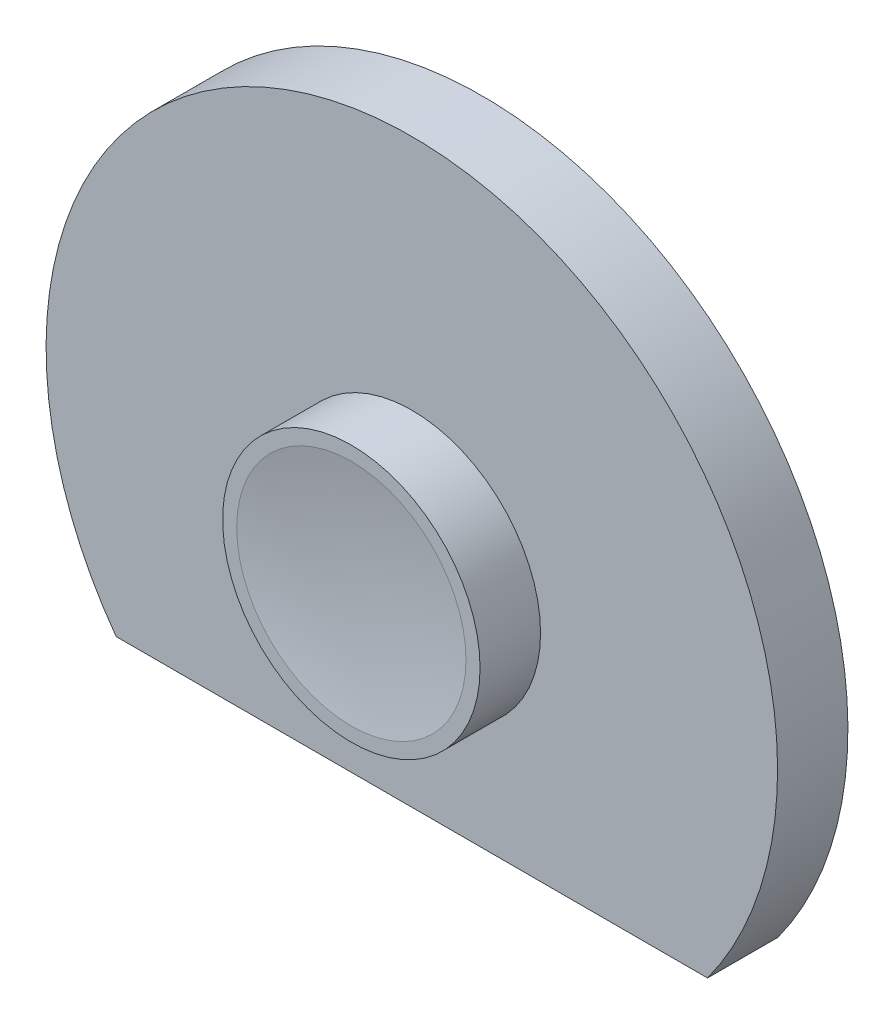
ISO-10303-21;
HEADER;
FILE_DESCRIPTION(('STEP AP214'),'2;1');
FILE_NAME('part.step','',(''),(''),'','','');
FILE_SCHEMA(('AUTOMOTIVE_DESIGN { 1 0 10303 214 1 1 1 1 }'));
ENDSEC;
DATA;
#1=APPLICATION_CONTEXT('core data for automotive mechanical design processes');
#2=APPLICATION_PROTOCOL_DEFINITION('international standard','automotive_design',2000,#1);
#3=PRODUCT_CONTEXT('',#1,'mechanical');
#4=PRODUCT('Part','Part','',(#3));
#5=PRODUCT_RELATED_PRODUCT_CATEGORY('part','',(#4));
#6=PRODUCT_DEFINITION_FORMATION('','',#4);
#7=PRODUCT_DEFINITION_CONTEXT('part definition',#1,'design');
#8=PRODUCT_DEFINITION('design','',#6,#7);
#9=PRODUCT_DEFINITION_SHAPE('','',#8);
#10=(LENGTH_UNIT() NAMED_UNIT(*) SI_UNIT(.MILLI.,.METRE.));
#11=(NAMED_UNIT(*) PLANE_ANGLE_UNIT() SI_UNIT($,.RADIAN.));
#12=(NAMED_UNIT(*) SI_UNIT($,.STERADIAN.) SOLID_ANGLE_UNIT());
#13=UNCERTAINTY_MEASURE_WITH_UNIT(LENGTH_MEASURE(1.E-05),#10,'distance_accuracy_value','');
#14=(GEOMETRIC_REPRESENTATION_CONTEXT(3) GLOBAL_UNCERTAINTY_ASSIGNED_CONTEXT((#13)) GLOBAL_UNIT_ASSIGNED_CONTEXT((#10,
#11,#12)) REPRESENTATION_CONTEXT('',''));
#15=CARTESIAN_POINT('',(0.,0.,0.));
#16=DIRECTION('',(0.,0.,1.));
#17=DIRECTION('',(1.,0.,0.));
#18=AXIS2_PLACEMENT_3D('',#15,#16,#17);
#19=CARTESIAN_POINT('',(0.,0.,5.));
#20=DIRECTION('',(0.,0.,-1.));
#21=DIRECTION('',(-1.,0.,0.));
#22=AXIS2_PLACEMENT_3D('',#19,#20,#21);
#23=CYLINDRICAL_SURFACE('',#22,26.);
#24=CARTESIAN_POINT('',(0.,0.,0.));
#25=DIRECTION('',(0.,0.,1.));
#26=DIRECTION('',(1.,0.,0.));
#27=AXIS2_PLACEMENT_3D('',#24,#25,#26);
#28=CIRCLE('',#27,26.);
#29=CARTESIAN_POINT('',(21.0216555009352,-15.3,0.));
#30=VERTEX_POINT('',#29);
#31=CARTESIAN_POINT('',(-21.0216555009352,-15.3,0.));
#32=VERTEX_POINT('',#31);
#33=EDGE_CURVE('E75',#30,#32,#28,.T.);
#34=ORIENTED_EDGE('',*,*,#33,.T.);
#35=DIRECTION('',(0.,0.,-1.));
#36=VECTOR('',#35,1.);
#37=CARTESIAN_POINT('',(-21.0216555009352,-15.3,5.));
#38=LINE('',#37,#36);
#39=CARTESIAN_POINT('',(-21.0216555009352,-15.3,5.));
#40=VERTEX_POINT('',#39);
#41=EDGE_CURVE('E42',#40,#32,#38,.T.);
#42=ORIENTED_EDGE('',*,*,#41,.F.);
#43=CARTESIAN_POINT('',(0.,0.,5.));
#44=DIRECTION('',(0.,0.,1.));
#45=DIRECTION('',(1.,0.,0.));
#46=AXIS2_PLACEMENT_3D('',#43,#44,#45);
#47=CIRCLE('',#46,26.);
#48=CARTESIAN_POINT('',(21.0216555009352,-15.3,5.));
#49=VERTEX_POINT('',#48);
#50=EDGE_CURVE('E74',#49,#40,#47,.T.);
#51=ORIENTED_EDGE('',*,*,#50,.F.);
#52=DIRECTION('',(0.,0.,-1.));
#53=VECTOR('',#52,1.);
#54=CARTESIAN_POINT('',(21.0216555009352,-15.3,5.));
#55=LINE('',#54,#53);
#56=EDGE_CURVE('E69',#49,#30,#55,.T.);
#57=ORIENTED_EDGE('',*,*,#56,.T.);
#58=EDGE_LOOP('',(#34,#42,#51,#57));
#59=FACE_BOUND('',#58,.T.);
#60=ADVANCED_FACE('F39',(#59),#23,.T.);
#61=CARTESIAN_POINT('',(-21.0216555009352,-15.3,5.));
#62=DIRECTION('',(0.,1.,0.));
#63=DIRECTION('',(0.,0.,1.));
#64=AXIS2_PLACEMENT_3D('',#61,#62,#63);
#65=PLANE('',#64);
#66=DIRECTION('',(1.,0.,0.));
#67=VECTOR('',#66,1.);
#68=CARTESIAN_POINT('',(-21.0216555009352,-15.3,0.));
#69=LINE('',#68,#67);
#70=EDGE_CURVE('E64',#32,#30,#69,.T.);
#71=ORIENTED_EDGE('',*,*,#70,.T.);
#72=ORIENTED_EDGE('',*,*,#56,.F.);
#73=DIRECTION('',(1.,0.,0.));
#74=VECTOR('',#73,1.);
#75=CARTESIAN_POINT('',(-21.0216555009352,-15.3,5.));
#76=LINE('',#75,#74);
#77=EDGE_CURVE('E56',#40,#49,#76,.T.);
#78=ORIENTED_EDGE('',*,*,#77,.F.);
#79=ORIENTED_EDGE('',*,*,#41,.T.);
#80=EDGE_LOOP('',(#71,#72,#78,#79));
#81=FACE_BOUND('',#80,.T.);
#82=ADVANCED_FACE('F68',(#81),#65,.F.);
#83=CARTESIAN_POINT('',(0.,0.,5.));
#84=DIRECTION('',(0.,0.,1.));
#85=DIRECTION('',(1.,0.,0.));
#86=AXIS2_PLACEMENT_3D('',#83,#84,#85);
#87=PLANE('',#86);
#88=CARTESIAN_POINT('',(0.,0.,5.));
#89=DIRECTION('',(0.,0.,1.));
#90=DIRECTION('',(1.,0.,0.));
#91=AXIS2_PLACEMENT_3D('',#88,#89,#90);
#92=CIRCLE('',#91,9.15);
#93=CARTESIAN_POINT('',(9.15,0.,5.));
#94=VERTEX_POINT('',#93);
#95=EDGE_CURVE('E11',#94,#94,#92,.T.);
#96=ORIENTED_EDGE('',*,*,#95,.F.);
#97=EDGE_LOOP('',(#96));
#98=FACE_BOUND('',#97,.T.);
#99=ORIENTED_EDGE('',*,*,#50,.T.);
#100=ORIENTED_EDGE('',*,*,#77,.T.);
#101=EDGE_LOOP('',(#99,#100));
#102=FACE_BOUND('',#101,.T.);
#103=ADVANCED_FACE('F110',(#98,#102),#87,.T.);
#104=CARTESIAN_POINT('',(0.,0.,0.));
#105=DIRECTION('',(0.,0.,1.));
#106=DIRECTION('',(1.,0.,0.));
#107=AXIS2_PLACEMENT_3D('',#104,#105,#106);
#108=PLANE('',#107);
#109=ORIENTED_EDGE('',*,*,#33,.F.);
#110=ORIENTED_EDGE('',*,*,#70,.F.);
#111=EDGE_LOOP('',(#109,#110));
#112=FACE_BOUND('',#111,.T.);
#113=ADVANCED_FACE('F79',(#112),#108,.F.);
#114=CARTESIAN_POINT('',(0.,0.,9.3));
#115=DIRECTION('',(0.,0.,-1.));
#116=DIRECTION('',(-1.,0.,0.));
#117=AXIS2_PLACEMENT_3D('',#114,#115,#116);
#118=CYLINDRICAL_SURFACE('',#117,9.15);
#119=CARTESIAN_POINT('',(0.,0.,9.3));
#120=DIRECTION('',(0.,0.,1.));
#121=DIRECTION('',(1.,0.,0.));
#122=AXIS2_PLACEMENT_3D('',#119,#120,#121);
#123=CIRCLE('',#122,9.15);
#124=CARTESIAN_POINT('',(9.15,0.,9.3));
#125=VERTEX_POINT('',#124);
#126=EDGE_CURVE('E81',#125,#125,#123,.T.);
#127=ORIENTED_EDGE('',*,*,#126,.F.);
#128=EDGE_LOOP('',(#127));
#129=FACE_BOUND('',#128,.T.);
#130=ORIENTED_EDGE('',*,*,#95,.T.);
#131=EDGE_LOOP('',(#130));
#132=FACE_BOUND('',#131,.T.);
#133=ADVANCED_FACE('F101',(#129,#132),#118,.T.);
#134=CARTESIAN_POINT('',(0.,0.,9.3));
#135=DIRECTION('',(0.,0.,1.));
#136=DIRECTION('',(1.,0.,0.));
#137=AXIS2_PLACEMENT_3D('',#134,#135,#136);
#138=PLANE('',#137);
#139=CARTESIAN_POINT('',(0.,0.,9.3));
#140=DIRECTION('',(0.,0.,1.));
#141=DIRECTION('',(1.,0.,0.));
#142=AXIS2_PLACEMENT_3D('',#139,#140,#141);
#143=CIRCLE('',#142,8.15);
#144=CARTESIAN_POINT('',(8.15,0.,9.3));
#145=VERTEX_POINT('',#144);
#146=EDGE_CURVE('E85',#145,#145,#143,.T.);
#147=ORIENTED_EDGE('',*,*,#146,.F.);
#148=EDGE_LOOP('',(#147));
#149=FACE_BOUND('',#148,.T.);
#150=ORIENTED_EDGE('',*,*,#126,.T.);
#151=EDGE_LOOP('',(#150));
#152=FACE_BOUND('',#151,.T.);
#153=ADVANCED_FACE('F98',(#149,#152),#138,.T.);
#154=CARTESIAN_POINT('',(0.,0.,58.6313034492299));
#155=DIRECTION('',(0.,0.,1.));
#156=DIRECTION('',(-1.,0.,0.));
#157=AXIS2_PLACEMENT_3D('',#154,#155,#156);
#158=SPHERICAL_SURFACE('',#157,50.);
#159=ORIENTED_EDGE('',*,*,#146,.T.);
#160=EDGE_LOOP('',(#159));
#161=FACE_BOUND('',#160,.T.);
#162=ADVANCED_FACE('F96',(#161),#158,.F.);
#163=CLOSED_SHELL('',(#60,#82,#103,#113,#133,#153,#162));
#164=MANIFOLD_SOLID_BREP('B2',#163);
#165=ADVANCED_BREP_SHAPE_REPRESENTATION('',(#18,#164),#14);
#166=SHAPE_DEFINITION_REPRESENTATION(#9,#165);
ENDSEC;
END-ISO-10303-21;
